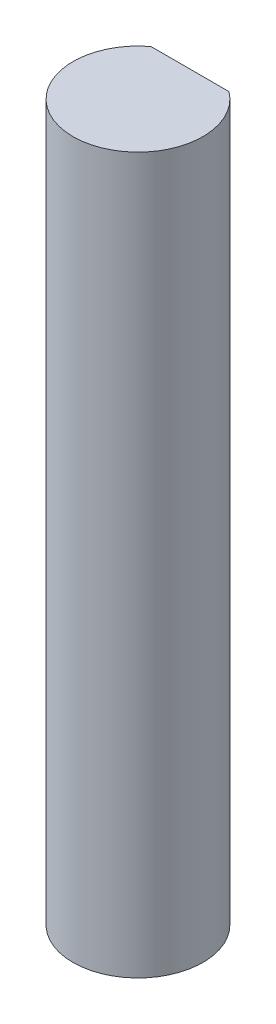
ISO-10303-21;
HEADER;
FILE_DESCRIPTION(('STEP AP214'),'2;1');
FILE_NAME('part.step','',(''),(''),'','','');
FILE_SCHEMA(('AUTOMOTIVE_DESIGN { 1 0 10303 214 1 1 1 1 }'));
ENDSEC;
DATA;
#1=APPLICATION_CONTEXT('core data for automotive mechanical design processes');
#2=APPLICATION_PROTOCOL_DEFINITION('international standard','automotive_design',2000,#1);
#3=PRODUCT_CONTEXT('',#1,'mechanical');
#4=PRODUCT('Part','Part','',(#3));
#5=PRODUCT_RELATED_PRODUCT_CATEGORY('part','',(#4));
#6=PRODUCT_DEFINITION_FORMATION('','',#4);
#7=PRODUCT_DEFINITION_CONTEXT('part definition',#1,'design');
#8=PRODUCT_DEFINITION('design','',#6,#7);
#9=PRODUCT_DEFINITION_SHAPE('','',#8);
#10=(LENGTH_UNIT() NAMED_UNIT(*) SI_UNIT(.MILLI.,.METRE.));
#11=(NAMED_UNIT(*) PLANE_ANGLE_UNIT() SI_UNIT($,.RADIAN.));
#12=(NAMED_UNIT(*) SI_UNIT($,.STERADIAN.) SOLID_ANGLE_UNIT());
#13=UNCERTAINTY_MEASURE_WITH_UNIT(LENGTH_MEASURE(1.E-05),#10,'distance_accuracy_value','');
#14=(GEOMETRIC_REPRESENTATION_CONTEXT(3) GLOBAL_UNCERTAINTY_ASSIGNED_CONTEXT((#13)) GLOBAL_UNIT_ASSIGNED_CONTEXT((#10,
#11,#12)) REPRESENTATION_CONTEXT('',''));
#15=CARTESIAN_POINT('',(0.,0.,0.));
#16=DIRECTION('',(0.,0.,1.));
#17=DIRECTION('',(1.,0.,0.));
#18=AXIS2_PLACEMENT_3D('',#15,#16,#17);
#19=CARTESIAN_POINT('',(0.,34.925,0.));
#20=DIRECTION('',(0.,-1.,0.));
#21=DIRECTION('',(0.,0.,-1.));
#22=AXIS2_PLACEMENT_3D('',#19,#20,#21);
#23=CYLINDRICAL_SURFACE('',#22,3.175);
#24=CARTESIAN_POINT('',(0.,0.,0.));
#25=DIRECTION('',(0.,1.,0.));
#26=DIRECTION('',(0.,0.,1.));
#27=AXIS2_PLACEMENT_3D('',#24,#25,#26);
#28=CIRCLE('',#27,3.175);
#29=CARTESIAN_POINT('',(-1.905,0.,-2.54));
#30=VERTEX_POINT('',#29);
#31=CARTESIAN_POINT('',(1.905,0.,-2.54));
#32=VERTEX_POINT('',#31);
#33=EDGE_CURVE('E64',#30,#32,#28,.T.);
#34=ORIENTED_EDGE('',*,*,#33,.T.);
#35=DIRECTION('',(0.,-1.,0.));
#36=VECTOR('',#35,1.);
#37=CARTESIAN_POINT('',(1.905,34.925,-2.54));
#38=LINE('',#37,#36);
#39=CARTESIAN_POINT('',(1.905,34.925,-2.54));
#40=VERTEX_POINT('',#39);
#41=EDGE_CURVE('E11',#40,#32,#38,.T.);
#42=ORIENTED_EDGE('',*,*,#41,.F.);
#43=CARTESIAN_POINT('',(0.,34.925,0.));
#44=DIRECTION('',(0.,1.,0.));
#45=DIRECTION('',(0.,0.,1.));
#46=AXIS2_PLACEMENT_3D('',#43,#44,#45);
#47=CIRCLE('',#46,3.175);
#48=CARTESIAN_POINT('',(-1.905,34.925,-2.54));
#49=VERTEX_POINT('',#48);
#50=EDGE_CURVE('E63',#49,#40,#47,.T.);
#51=ORIENTED_EDGE('',*,*,#50,.F.);
#52=DIRECTION('',(0.,-1.,0.));
#53=VECTOR('',#52,1.);
#54=CARTESIAN_POINT('',(-1.905,34.925,-2.54));
#55=LINE('',#54,#53);
#56=EDGE_CURVE('E41',#49,#30,#55,.T.);
#57=ORIENTED_EDGE('',*,*,#56,.T.);
#58=EDGE_LOOP('',(#34,#42,#51,#57));
#59=FACE_BOUND('',#58,.T.);
#60=ADVANCED_FACE('F33',(#59),#23,.T.);
#61=CARTESIAN_POINT('',(-1.905,34.925,-2.54));
#62=DIRECTION('',(0.,0.,1.));
#63=DIRECTION('',(1.,0.,0.));
#64=AXIS2_PLACEMENT_3D('',#61,#62,#63);
#65=PLANE('',#64);
#66=DIRECTION('',(-1.,0.,0.));
#67=VECTOR('',#66,1.);
#68=CARTESIAN_POINT('',(-1.905,0.,-2.54));
#69=LINE('',#68,#67);
#70=EDGE_CURVE('E56',#32,#30,#69,.T.);
#71=ORIENTED_EDGE('',*,*,#70,.T.);
#72=ORIENTED_EDGE('',*,*,#56,.F.);
#73=DIRECTION('',(-1.,0.,0.));
#74=VECTOR('',#73,1.);
#75=CARTESIAN_POINT('',(-1.905,34.925,-2.54));
#76=LINE('',#75,#74);
#77=EDGE_CURVE('E48',#40,#49,#76,.T.);
#78=ORIENTED_EDGE('',*,*,#77,.F.);
#79=ORIENTED_EDGE('',*,*,#41,.T.);
#80=EDGE_LOOP('',(#71,#72,#78,#79));
#81=FACE_BOUND('',#80,.T.);
#82=ADVANCED_FACE('F59',(#81),#65,.F.);
#83=CARTESIAN_POINT('',(0.,34.925,0.));
#84=DIRECTION('',(0.,1.,0.));
#85=DIRECTION('',(0.,0.,1.));
#86=AXIS2_PLACEMENT_3D('',#83,#84,#85);
#87=PLANE('',#86);
#88=ORIENTED_EDGE('',*,*,#50,.T.);
#89=ORIENTED_EDGE('',*,*,#77,.T.);
#90=EDGE_LOOP('',(#88,#89));
#91=FACE_BOUND('',#90,.T.);
#92=ADVANCED_FACE('F71',(#91),#87,.T.);
#93=CARTESIAN_POINT('',(0.,0.,0.));
#94=DIRECTION('',(0.,1.,0.));
#95=DIRECTION('',(0.,0.,1.));
#96=AXIS2_PLACEMENT_3D('',#93,#94,#95);
#97=PLANE('',#96);
#98=ORIENTED_EDGE('',*,*,#33,.F.);
#99=ORIENTED_EDGE('',*,*,#70,.F.);
#100=EDGE_LOOP('',(#98,#99));
#101=FACE_BOUND('',#100,.T.);
#102=ADVANCED_FACE('F67',(#101),#97,.F.);
#103=CLOSED_SHELL('',(#60,#82,#92,#102));
#104=MANIFOLD_SOLID_BREP('B2',#103);
#105=ADVANCED_BREP_SHAPE_REPRESENTATION('',(#18,#104),#14);
#106=SHAPE_DEFINITION_REPRESENTATION(#9,#105);
ENDSEC;
END-ISO-10303-21;
